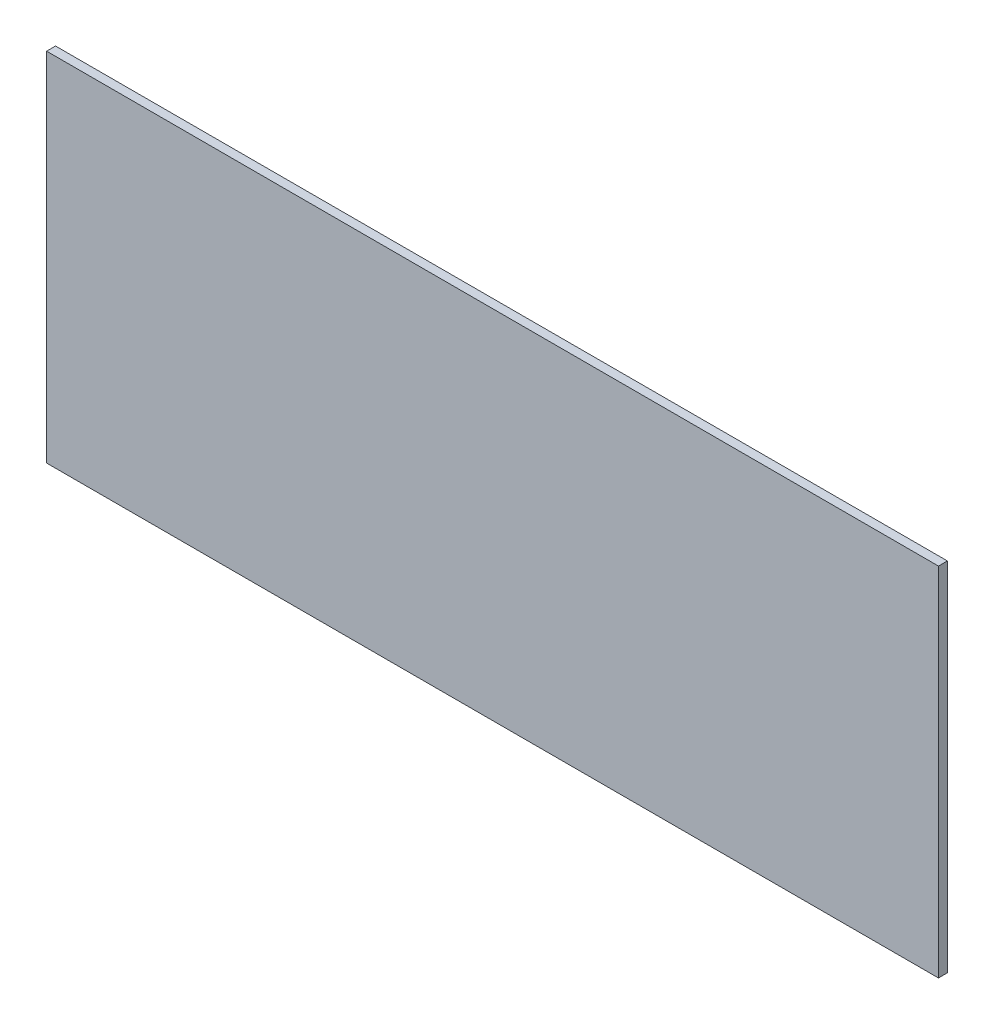
ISO-10303-21;
HEADER;
FILE_DESCRIPTION(('STEP AP214'),'2;1');
FILE_NAME('part.step','',(''),(''),'','','');
FILE_SCHEMA(('AUTOMOTIVE_DESIGN { 1 0 10303 214 1 1 1 1 }'));
ENDSEC;
DATA;
#1=APPLICATION_CONTEXT('core data for automotive mechanical design processes');
#2=APPLICATION_PROTOCOL_DEFINITION('international standard','automotive_design',2000,#1);
#3=PRODUCT_CONTEXT('',#1,'mechanical');
#4=PRODUCT('Part','Part','',(#3));
#5=PRODUCT_RELATED_PRODUCT_CATEGORY('part','',(#4));
#6=PRODUCT_DEFINITION_FORMATION('','',#4);
#7=PRODUCT_DEFINITION_CONTEXT('part definition',#1,'design');
#8=PRODUCT_DEFINITION('design','',#6,#7);
#9=PRODUCT_DEFINITION_SHAPE('','',#8);
#10=(LENGTH_UNIT() NAMED_UNIT(*) SI_UNIT(.MILLI.,.METRE.));
#11=(NAMED_UNIT(*) PLANE_ANGLE_UNIT() SI_UNIT($,.RADIAN.));
#12=(NAMED_UNIT(*) SI_UNIT($,.STERADIAN.) SOLID_ANGLE_UNIT());
#13=UNCERTAINTY_MEASURE_WITH_UNIT(LENGTH_MEASURE(1.E-05),#10,'distance_accuracy_value','');
#14=(GEOMETRIC_REPRESENTATION_CONTEXT(3) GLOBAL_UNCERTAINTY_ASSIGNED_CONTEXT((#13)) GLOBAL_UNIT_ASSIGNED_CONTEXT((#10,
#11,#12)) REPRESENTATION_CONTEXT('',''));
#15=CARTESIAN_POINT('',(0.,0.,0.));
#16=DIRECTION('',(0.,0.,1.));
#17=DIRECTION('',(1.,0.,0.));
#18=AXIS2_PLACEMENT_3D('',#15,#16,#17);
#19=CARTESIAN_POINT('',(0.,0.,0.2));
#20=DIRECTION('',(0.,0.,1.));
#21=DIRECTION('',(1.,0.,0.));
#22=AXIS2_PLACEMENT_3D('',#19,#20,#21);
#23=PLANE('',#22);
#24=DIRECTION('',(-1.,0.,0.));
#25=VECTOR('',#24,1.);
#26=CARTESIAN_POINT('',(10.,4.,0.199999999255));
#27=LINE('',#26,#25);
#28=CARTESIAN_POINT('',(-10.,4.,0.1999999996275));
#29=VERTEX_POINT('',#28);
#30=CARTESIAN_POINT('',(10.,4.,0.1999999996275));
#31=VERTEX_POINT('',#30);
#32=EDGE_CURVE('E57',#29,#31,#27,.F.);
#33=ORIENTED_EDGE('',*,*,#32,.F.);
#34=DIRECTION('',(0.,-1.,0.));
#35=VECTOR('',#34,1.);
#36=CARTESIAN_POINT('',(-10.,4.,0.199999999255));
#37=LINE('',#36,#35);
#38=CARTESIAN_POINT('',(-10.,-4.,0.1999999996275));
#39=VERTEX_POINT('',#38);
#40=EDGE_CURVE('E52',#39,#29,#37,.F.);
#41=ORIENTED_EDGE('',*,*,#40,.F.);
#42=DIRECTION('',(1.,0.,0.));
#43=VECTOR('',#42,1.);
#44=CARTESIAN_POINT('',(-10.,-4.,0.199999999255));
#45=LINE('',#44,#43);
#46=CARTESIAN_POINT('',(10.,-4.,0.19999999944125));
#47=VERTEX_POINT('',#46);
#48=EDGE_CURVE('E67',#47,#39,#45,.F.);
#49=ORIENTED_EDGE('',*,*,#48,.F.);
#50=DIRECTION('',(0.,1.,0.));
#51=VECTOR('',#50,1.);
#52=CARTESIAN_POINT('',(10.,-4.,0.199999999255));
#53=LINE('',#52,#51);
#54=EDGE_CURVE('E19',#31,#47,#53,.F.);
#55=ORIENTED_EDGE('',*,*,#54,.F.);
#56=EDGE_LOOP('',(#33,#41,#49,#55));
#57=FACE_BOUND('',#56,.T.);
#58=ADVANCED_FACE('F16',(#57),#23,.T.);
#59=CARTESIAN_POINT('',(10.,-4.,0.));
#60=DIRECTION('',(1.,0.,0.));
#61=DIRECTION('',(0.,1.,0.));
#62=AXIS2_PLACEMENT_3D('',#59,#60,#61);
#63=PLANE('',#62);
#64=ORIENTED_EDGE('',*,*,#54,.T.);
#65=DIRECTION('',(0.,0.,-1.));
#66=VECTOR('',#65,1.);
#67=CARTESIAN_POINT('',(10.,-4.,0.));
#68=LINE('',#67,#66);
#69=CARTESIAN_POINT('',(10.,-4.,0.));
#70=VERTEX_POINT('',#69);
#71=EDGE_CURVE('E78',#70,#47,#68,.F.);
#72=ORIENTED_EDGE('',*,*,#71,.F.);
#73=DIRECTION('',(0.,1.,0.));
#74=VECTOR('',#73,1.);
#75=CARTESIAN_POINT('',(10.,0.,0.));
#76=LINE('',#75,#74);
#77=CARTESIAN_POINT('',(10.,4.,0.));
#78=VERTEX_POINT('',#77);
#79=EDGE_CURVE('E73',#70,#78,#76,.T.);
#80=ORIENTED_EDGE('',*,*,#79,.T.);
#81=DIRECTION('',(0.,0.,1.));
#82=VECTOR('',#81,1.);
#83=CARTESIAN_POINT('',(10.,4.,0.));
#84=LINE('',#83,#82);
#85=EDGE_CURVE('E62',#31,#78,#84,.F.);
#86=ORIENTED_EDGE('',*,*,#85,.F.);
#87=EDGE_LOOP('',(#64,#72,#80,#86));
#88=FACE_BOUND('',#87,.T.);
#89=ADVANCED_FACE('F72',(#88),#63,.T.);
#90=CARTESIAN_POINT('',(10.,4.,0.));
#91=DIRECTION('',(0.,1.,0.));
#92=DIRECTION('',(-1.,0.,0.));
#93=AXIS2_PLACEMENT_3D('',#90,#91,#92);
#94=PLANE('',#93);
#95=ORIENTED_EDGE('',*,*,#32,.T.);
#96=ORIENTED_EDGE('',*,*,#85,.T.);
#97=DIRECTION('',(1.,0.,0.));
#98=VECTOR('',#97,1.);
#99=CARTESIAN_POINT('',(0.,4.,0.));
#100=LINE('',#99,#98);
#101=CARTESIAN_POINT('',(-10.,4.,0.));
#102=VERTEX_POINT('',#101);
#103=EDGE_CURVE('E83',#78,#102,#100,.F.);
#104=ORIENTED_EDGE('',*,*,#103,.T.);
#105=DIRECTION('',(0.,0.,1.));
#106=VECTOR('',#105,1.);
#107=CARTESIAN_POINT('',(-10.,4.,0.));
#108=LINE('',#107,#106);
#109=EDGE_CURVE('E64',#29,#102,#108,.F.);
#110=ORIENTED_EDGE('',*,*,#109,.F.);
#111=EDGE_LOOP('',(#95,#96,#104,#110));
#112=FACE_BOUND('',#111,.T.);
#113=ADVANCED_FACE('F59',(#112),#94,.T.);
#114=CARTESIAN_POINT('',(-10.,4.,0.));
#115=DIRECTION('',(-1.,0.,0.));
#116=DIRECTION('',(0.,-1.,0.));
#117=AXIS2_PLACEMENT_3D('',#114,#115,#116);
#118=PLANE('',#117);
#119=ORIENTED_EDGE('',*,*,#40,.T.);
#120=ORIENTED_EDGE('',*,*,#109,.T.);
#121=DIRECTION('',(0.,1.,0.));
#122=VECTOR('',#121,1.);
#123=CARTESIAN_POINT('',(-10.,0.,0.));
#124=LINE('',#123,#122);
#125=CARTESIAN_POINT('',(-10.,-4.,0.));
#126=VERTEX_POINT('',#125);
#127=EDGE_CURVE('E25',#102,#126,#124,.F.);
#128=ORIENTED_EDGE('',*,*,#127,.T.);
#129=DIRECTION('',(0.,0.,-1.));
#130=VECTOR('',#129,1.);
#131=CARTESIAN_POINT('',(-10.,-4.,0.));
#132=LINE('',#131,#130);
#133=EDGE_CURVE('E33',#39,#126,#132,.T.);
#134=ORIENTED_EDGE('',*,*,#133,.F.);
#135=EDGE_LOOP('',(#119,#120,#128,#134));
#136=FACE_BOUND('',#135,.T.);
#137=ADVANCED_FACE('F87',(#136),#118,.T.);
#138=CARTESIAN_POINT('',(-10.,-4.,0.));
#139=DIRECTION('',(0.,-1.,0.));
#140=DIRECTION('',(0.,0.,-1.));
#141=AXIS2_PLACEMENT_3D('',#138,#139,#140);
#142=PLANE('',#141);
#143=ORIENTED_EDGE('',*,*,#48,.T.);
#144=ORIENTED_EDGE('',*,*,#133,.T.);
#145=DIRECTION('',(1.,0.,0.));
#146=VECTOR('',#145,1.);
#147=CARTESIAN_POINT('',(0.,-4.,0.));
#148=LINE('',#147,#146);
#149=EDGE_CURVE('E10',#126,#70,#148,.T.);
#150=ORIENTED_EDGE('',*,*,#149,.T.);
#151=ORIENTED_EDGE('',*,*,#71,.T.);
#152=EDGE_LOOP('',(#143,#144,#150,#151));
#153=FACE_BOUND('',#152,.T.);
#154=ADVANCED_FACE('F90',(#153),#142,.T.);
#155=CARTESIAN_POINT('',(0.,0.,0.));
#156=DIRECTION('',(0.,0.,1.));
#157=DIRECTION('',(1.,0.,0.));
#158=AXIS2_PLACEMENT_3D('',#155,#156,#157);
#159=PLANE('',#158);
#160=ORIENTED_EDGE('',*,*,#127,.F.);
#161=ORIENTED_EDGE('',*,*,#103,.F.);
#162=ORIENTED_EDGE('',*,*,#79,.F.);
#163=ORIENTED_EDGE('',*,*,#149,.F.);
#164=EDGE_LOOP('',(#160,#161,#162,#163));
#165=FACE_BOUND('',#164,.T.);
#166=ADVANCED_FACE('F89',(#165),#159,.F.);
#167=CLOSED_SHELL('',(#58,#89,#113,#137,#154,#166));
#168=MANIFOLD_SOLID_BREP('B1',#167);
#169=ADVANCED_BREP_SHAPE_REPRESENTATION('',(#18,#168),#14);
#170=SHAPE_DEFINITION_REPRESENTATION(#9,#169);
ENDSEC;
END-ISO-10303-21;
